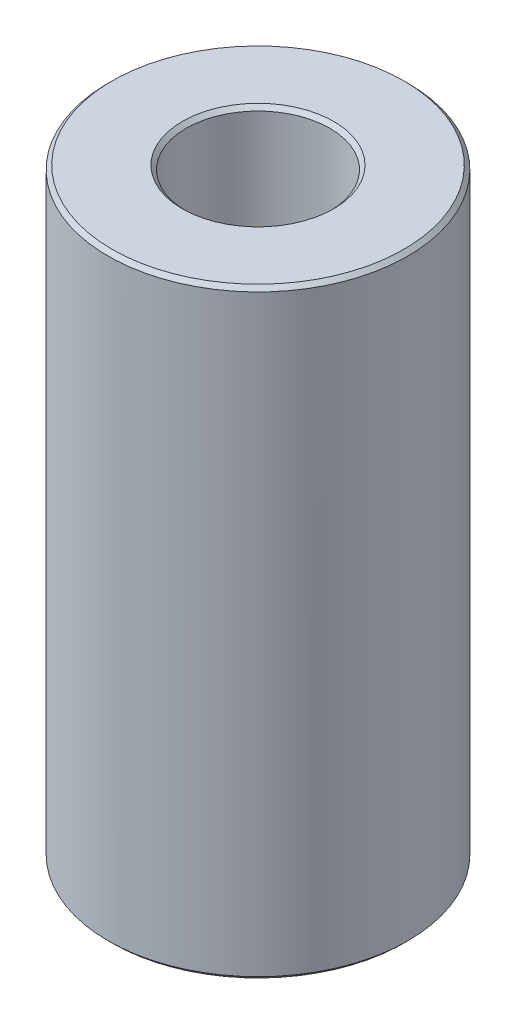
ISO-10303-21;
HEADER;
FILE_DESCRIPTION(('STEP AP214'),'2;1');
FILE_NAME('part.step','',(''),(''),'','','');
FILE_SCHEMA(('AUTOMOTIVE_DESIGN { 1 0 10303 214 1 1 1 1 }'));
ENDSEC;
DATA;
#1=APPLICATION_CONTEXT('core data for automotive mechanical design processes');
#2=APPLICATION_PROTOCOL_DEFINITION('international standard','automotive_design',2000,#1);
#3=PRODUCT_CONTEXT('',#1,'mechanical');
#4=PRODUCT('Part','Part','',(#3));
#5=PRODUCT_RELATED_PRODUCT_CATEGORY('part','',(#4));
#6=PRODUCT_DEFINITION_FORMATION('','',#4);
#7=PRODUCT_DEFINITION_CONTEXT('part definition',#1,'design');
#8=PRODUCT_DEFINITION('design','',#6,#7);
#9=PRODUCT_DEFINITION_SHAPE('','',#8);
#10=(LENGTH_UNIT() NAMED_UNIT(*) SI_UNIT(.MILLI.,.METRE.));
#11=(NAMED_UNIT(*) PLANE_ANGLE_UNIT() SI_UNIT($,.RADIAN.));
#12=(NAMED_UNIT(*) SI_UNIT($,.STERADIAN.) SOLID_ANGLE_UNIT());
#13=UNCERTAINTY_MEASURE_WITH_UNIT(LENGTH_MEASURE(1.E-05),#10,'distance_accuracy_value','');
#14=(GEOMETRIC_REPRESENTATION_CONTEXT(3) GLOBAL_UNCERTAINTY_ASSIGNED_CONTEXT((#13)) GLOBAL_UNIT_ASSIGNED_CONTEXT((#10,
#11,#12)) REPRESENTATION_CONTEXT('',''));
#15=CARTESIAN_POINT('',(0.,0.,0.));
#16=DIRECTION('',(0.,0.,1.));
#17=DIRECTION('',(1.,0.,0.));
#18=AXIS2_PLACEMENT_3D('',#15,#16,#17);
#19=CARTESIAN_POINT('',(0.,220.569360550062,0.));
#20=DIRECTION('',(0.,-1.,0.));
#21=DIRECTION('',(0.,0.,-1.));
#22=AXIS2_PLACEMENT_3D('',#19,#20,#21);
#23=CYLINDRICAL_SURFACE('',#22,55.);
#24=CARTESIAN_POINT('',(0.,1.44398311611005,0.));
#25=DIRECTION('',(0.,1.,0.));
#26=DIRECTION('',(0.,0.,1.));
#27=AXIS2_PLACEMENT_3D('',#24,#25,#26);
#28=CIRCLE('',#27,55.);
#29=CARTESIAN_POINT('',(0.,1.44398311611002,-55.));
#30=VERTEX_POINT('',#29);
#31=EDGE_CURVE('E10',#30,#30,#28,.T.);
#32=CARTESIAN_POINT('',(0.,219.125377433953,0.));
#33=DIRECTION('',(0.,1.,0.));
#34=DIRECTION('',(0.,0.,1.));
#35=AXIS2_PLACEMENT_3D('',#32,#33,#34);
#36=CIRCLE('',#35,55.);
#37=CARTESIAN_POINT('',(0.,219.125377433953,-55.));
#38=VERTEX_POINT('',#37);
#39=EDGE_CURVE('E50',#38,#38,#36,.F.);
#40=CARTESIAN_POINT('',(0.,1.44398311611002,-55.));
#41=CARTESIAN_POINT('',(0.,3.71149764025421,-55.));
#42=CARTESIAN_POINT('',(0.,5.9790121643984,-55.));
#43=CARTESIAN_POINT('',(0.,10.5140412126868,-55.));
#44=CARTESIAN_POINT('',(0.,12.781555736831,-55.));
#45=CARTESIAN_POINT('',(0.,17.3165847851194,-55.));
#46=CARTESIAN_POINT('',(0.,19.5840993092636,-55.));
#47=CARTESIAN_POINT('',(0.,24.119128357552,-55.));
#48=CARTESIAN_POINT('',(0.,26.3866428816961,-55.));
#49=CARTESIAN_POINT('',(0.,30.9216719299845,-55.));
#50=CARTESIAN_POINT('',(0.,33.1891864541287,-55.));
#51=CARTESIAN_POINT('',(0.,37.7242155024171,-55.));
#52=CARTESIAN_POINT('',(0.,39.9917300265613,-55.));
#53=CARTESIAN_POINT('',(0.,44.5267590748497,-55.));
#54=CARTESIAN_POINT('',(0.,46.7942735989939,-55.));
#55=CARTESIAN_POINT('',(0.,51.3293026472823,-55.));
#56=CARTESIAN_POINT('',(0.,53.5968171714265,-55.));
#57=CARTESIAN_POINT('',(0.,58.1318462197148,-55.));
#58=CARTESIAN_POINT('',(0.,60.399360743859,-55.));
#59=CARTESIAN_POINT('',(0.,64.9343897921474,-55.));
#60=CARTESIAN_POINT('',(0.,67.2019043162916,-55.));
#61=CARTESIAN_POINT('',(0.,71.73693336458,-55.));
#62=CARTESIAN_POINT('',(0.,74.0044478887242,-55.));
#63=CARTESIAN_POINT('',(0.,78.5394769370126,-55.));
#64=CARTESIAN_POINT('',(0.,80.8069914611568,-55.));
#65=CARTESIAN_POINT('',(0.,85.3420205094452,-55.));
#66=CARTESIAN_POINT('',(0.,87.6095350335894,-55.));
#67=CARTESIAN_POINT('',(0.,92.1445640818777,-55.));
#68=CARTESIAN_POINT('',(0.,94.4120786060219,-55.));
#69=CARTESIAN_POINT('',(0.,98.9471076543103,-55.));
#70=CARTESIAN_POINT('',(0.,101.214622178454,-55.));
#71=CARTESIAN_POINT('',(0.,105.749651226743,-55.));
#72=CARTESIAN_POINT('',(0.,108.017165750887,-55.));
#73=CARTESIAN_POINT('',(0.,112.552194799175,-55.));
#74=CARTESIAN_POINT('',(0.,114.81970932332,-55.));
#75=CARTESIAN_POINT('',(0.,119.354738371608,-55.));
#76=CARTESIAN_POINT('',(0.,121.622252895752,-55.));
#77=CARTESIAN_POINT('',(0.,126.157281944041,-55.));
#78=CARTESIAN_POINT('',(0.,128.424796468185,-55.));
#79=CARTESIAN_POINT('',(0.,132.959825516473,-55.));
#80=CARTESIAN_POINT('',(0.,135.227340040617,-55.));
#81=CARTESIAN_POINT('',(0.,139.762369088906,-55.));
#82=CARTESIAN_POINT('',(0.,142.02988361305,-55.));
#83=CARTESIAN_POINT('',(0.,146.564912661338,-55.));
#84=CARTESIAN_POINT('',(0.,148.832427185483,-55.));
#85=CARTESIAN_POINT('',(0.,153.367456233771,-55.));
#86=CARTESIAN_POINT('',(0.,155.634970757915,-55.));
#87=CARTESIAN_POINT('',(0.,160.169999806203,-55.));
#88=CARTESIAN_POINT('',(0.,162.437514330348,-55.));
#89=CARTESIAN_POINT('',(0.,166.972543378636,-55.));
#90=CARTESIAN_POINT('',(0.,169.24005790278,-55.));
#91=CARTESIAN_POINT('',(0.,173.775086951069,-55.));
#92=CARTESIAN_POINT('',(0.,176.042601475213,-55.));
#93=CARTESIAN_POINT('',(0.,180.577630523501,-55.));
#94=CARTESIAN_POINT('',(0.,182.845145047645,-55.));
#95=CARTESIAN_POINT('',(0.,187.380174095934,-55.));
#96=CARTESIAN_POINT('',(0.,189.647688620078,-55.));
#97=CARTESIAN_POINT('',(0.,194.182717668366,-55.));
#98=CARTESIAN_POINT('',(0.,196.450232192511,-55.));
#99=CARTESIAN_POINT('',(0.,200.985261240799,-55.));
#100=CARTESIAN_POINT('',(0.,203.252775764943,-55.));
#101=CARTESIAN_POINT('',(0.,207.787804813232,-55.));
#102=CARTESIAN_POINT('',(0.,210.055319337376,-55.));
#103=CARTESIAN_POINT('',(0.,214.590348385664,-55.));
#104=CARTESIAN_POINT('',(0.,216.857862909808,-55.));
#105=CARTESIAN_POINT('',(0.,219.125377433953,-55.));
#106=B_SPLINE_CURVE_WITH_KNOTS('',3,(#40,#41,#42,#43,#44,#45,#46,#47,#48,#49,#50,#51,#52,#53,
#54,#55,#56,#57,#58,#59,#60,#61,#62,#63,#64,#65,#66,#67,#68,#69,#70,#71,#72,#73,#74,#75,#76,#77,
#78,#79,#80,#81,#82,#83,#84,#85,#86,#87,#88,#89,#90,#91,#92,#93,#94,#95,#96,#97,#98,#99,#100,
#101,#102,#103,#104,#105),.UNSPECIFIED.,.F.,.F.,(4,2,2,2,2,2,2,2,2,2,2,2,2,2,2,2,2,2,2,2,2,2,2,
2,2,2,2,2,2,2,2,2,4),(0.,6.80254357243257,13.6050871448652,20.4076307172977,27.2101742897303,
34.0127178621629,40.8152614345955,47.6178050070281,54.4203485794606,61.2228921518932,
68.0254357243258,74.8279792967584,81.630522869191,88.4330664416235,95.2356100140561,
102.038153586489,108.840697158921,115.643240731354,122.445784303786,129.248327876219,
136.050871448652,142.853415021084,149.655958593517,156.458502165949,163.261045738382,
170.063589310814,176.866132883247,183.66867645568,190.471220028112,197.273763600545,
204.076307172977,210.87885074541,217.681394317842),.UNSPECIFIED.);
#107=EDGE_CURVE('BSEAM39',#30,#38,#106,.T.);
#108=ORIENTED_EDGE('',*,*,#31,.T.);
#109=ORIENTED_EDGE('',*,*,#39,.T.);
#110=ORIENTED_EDGE('',*,*,#107,.T.);
#111=ORIENTED_EDGE('',*,*,#107,.F.);
#112=EDGE_LOOP('',(#108,#110,#109,#111));
#113=FACE_BOUND('',#112,.T.);
#114=ADVANCED_FACE('F39',(#113),#23,.T.);
#115=CARTESIAN_POINT('',(0.,220.569360550062,0.));
#116=DIRECTION('',(0.,1.,0.));
#117=DIRECTION('',(0.,0.,1.));
#118=AXIS2_PLACEMENT_3D('',#115,#116,#117);
#119=PLANE('',#118);
#120=CARTESIAN_POINT('',(0.,220.569360550062,0.));
#121=DIRECTION('',(0.,1.,0.));
#122=DIRECTION('',(0.,0.,1.));
#123=AXIS2_PLACEMENT_3D('',#120,#121,#122);
#124=CIRCLE('',#123,27.7944788995037);
#125=CARTESIAN_POINT('',(0.,220.569360550062,27.7944788995037));
#126=VERTEX_POINT('',#125);
#127=EDGE_CURVE('E58',#126,#126,#124,.F.);
#128=ORIENTED_EDGE('',*,*,#127,.T.);
#129=EDGE_LOOP('',(#128));
#130=FACE_BOUND('',#129,.T.);
#131=CARTESIAN_POINT('',(0.,220.569360550062,0.));
#132=DIRECTION('',(0.,1.,0.));
#133=DIRECTION('',(0.,0.,1.));
#134=AXIS2_PLACEMENT_3D('',#131,#132,#133);
#135=CIRCLE('',#134,53.5560168838903);
#136=CARTESIAN_POINT('',(0.,220.569360550062,53.5560168838903));
#137=VERTEX_POINT('',#136);
#138=EDGE_CURVE('E61',#137,#137,#135,.T.);
#139=ORIENTED_EDGE('',*,*,#138,.T.);
#140=EDGE_LOOP('',(#139));
#141=FACE_BOUND('',#140,.T.);
#142=ADVANCED_FACE('F88',(#130,#141),#119,.T.);
#143=CARTESIAN_POINT('',(0.,0.,0.));
#144=DIRECTION('',(0.,1.,0.));
#145=DIRECTION('',(0.,0.,1.));
#146=AXIS2_PLACEMENT_3D('',#143,#144,#145);
#147=PLANE('',#146);
#148=CARTESIAN_POINT('',(0.,0.,0.));
#149=DIRECTION('',(0.,1.,0.));
#150=DIRECTION('',(0.,0.,1.));
#151=AXIS2_PLACEMENT_3D('',#148,#149,#150);
#152=CIRCLE('',#151,27.7944788995036);
#153=CARTESIAN_POINT('',(0.,0.,-27.7944788995036));
#154=VERTEX_POINT('',#153);
#155=EDGE_CURVE('E51',#154,#154,#152,.T.);
#156=ORIENTED_EDGE('',*,*,#155,.T.);
#157=EDGE_LOOP('',(#156));
#158=FACE_BOUND('',#157,.T.);
#159=CARTESIAN_POINT('',(0.,0.,0.));
#160=DIRECTION('',(0.,1.,0.));
#161=DIRECTION('',(0.,0.,1.));
#162=AXIS2_PLACEMENT_3D('',#159,#160,#161);
#163=CIRCLE('',#162,53.55601688389);
#164=CARTESIAN_POINT('',(0.,0.,53.55601688389));
#165=VERTEX_POINT('',#164);
#166=EDGE_CURVE('E54',#165,#165,#163,.F.);
#167=ORIENTED_EDGE('',*,*,#166,.T.);
#168=EDGE_LOOP('',(#167));
#169=FACE_BOUND('',#168,.T.);
#170=ADVANCED_FACE('F83',(#158,#169),#147,.F.);
#171=CARTESIAN_POINT('',(0.,220.569360550062,0.));
#172=DIRECTION('',(0.,-1.,0.));
#173=DIRECTION('',(0.,0.,-1.));
#174=AXIS2_PLACEMENT_3D('',#171,#172,#173);
#175=CYLINDRICAL_SURFACE('',#174,26.3504957833938);
#176=CARTESIAN_POINT('',(0.,219.125377433952,0.));
#177=DIRECTION('',(0.,1.,0.));
#178=DIRECTION('',(0.,0.,1.));
#179=AXIS2_PLACEMENT_3D('',#176,#177,#178);
#180=CIRCLE('',#179,26.3504957833938);
#181=CARTESIAN_POINT('',(0.,219.125377433952,-26.3504957833938));
#182=VERTEX_POINT('',#181);
#183=EDGE_CURVE('E67',#182,#182,#180,.T.);
#184=CARTESIAN_POINT('',(0.,1.44398311610977,0.));
#185=DIRECTION('',(0.,1.,0.));
#186=DIRECTION('',(0.,0.,1.));
#187=AXIS2_PLACEMENT_3D('',#184,#185,#186);
#188=CIRCLE('',#187,26.3504957833938);
#189=CARTESIAN_POINT('',(0.,1.44398311610974,-26.3504957833938));
#190=VERTEX_POINT('',#189);
#191=EDGE_CURVE('E69',#190,#190,#188,.F.);
#192=CARTESIAN_POINT('',(0.,219.125377433952,-26.3504957833938));
#193=CARTESIAN_POINT('',(0.,216.857862909808,-26.3504957833938));
#194=CARTESIAN_POINT('',(0.,214.590348385664,-26.3504957833938));
#195=CARTESIAN_POINT('',(0.,210.055319337376,-26.3504957833938));
#196=CARTESIAN_POINT('',(0.,207.787804813231,-26.3504957833938));
#197=CARTESIAN_POINT('',(0.,203.252775764943,-26.3504957833938));
#198=CARTESIAN_POINT('',(0.,200.985261240799,-26.3504957833938));
#199=CARTESIAN_POINT('',(0.,196.45023219251,-26.3504957833938));
#200=CARTESIAN_POINT('',(0.,194.182717668366,-26.3504957833938));
#201=CARTESIAN_POINT('',(0.,189.647688620078,-26.3504957833938));
#202=CARTESIAN_POINT('',(0.,187.380174095934,-26.3504957833938));
#203=CARTESIAN_POINT('',(0.,182.845145047645,-26.3504957833938));
#204=CARTESIAN_POINT('',(0.,180.577630523501,-26.3504957833938));
#205=CARTESIAN_POINT('',(0.,176.042601475213,-26.3504957833938));
#206=CARTESIAN_POINT('',(0.,173.775086951068,-26.3504957833938));
#207=CARTESIAN_POINT('',(0.,169.24005790278,-26.3504957833938));
#208=CARTESIAN_POINT('',(0.,166.972543378636,-26.3504957833938));
#209=CARTESIAN_POINT('',(0.,162.437514330348,-26.3504957833938));
#210=CARTESIAN_POINT('',(0.,160.169999806203,-26.3504957833938));
#211=CARTESIAN_POINT('',(0.,155.634970757915,-26.3504957833938));
#212=CARTESIAN_POINT('',(0.,153.367456233771,-26.3504957833938));
#213=CARTESIAN_POINT('',(0.,148.832427185482,-26.3504957833938));
#214=CARTESIAN_POINT('',(0.,146.564912661338,-26.3504957833938));
#215=CARTESIAN_POINT('',(0.,142.02988361305,-26.3504957833938));
#216=CARTESIAN_POINT('',(0.,139.762369088906,-26.3504957833938));
#217=CARTESIAN_POINT('',(0.,135.227340040617,-26.3504957833938));
#218=CARTESIAN_POINT('',(0.,132.959825516473,-26.3504957833938));
#219=CARTESIAN_POINT('',(0.,128.424796468185,-26.3504957833938));
#220=CARTESIAN_POINT('',(0.,126.15728194404,-26.3504957833938));
#221=CARTESIAN_POINT('',(0.,121.622252895752,-26.3504957833938));
#222=CARTESIAN_POINT('',(0.,119.354738371608,-26.3504957833938));
#223=CARTESIAN_POINT('',(0.,114.819709323319,-26.3504957833938));
#224=CARTESIAN_POINT('',(0.,112.552194799175,-26.3504957833938));
#225=CARTESIAN_POINT('',(0.,108.017165750887,-26.3504957833938));
#226=CARTESIAN_POINT('',(0.,105.749651226743,-26.3504957833938));
#227=CARTESIAN_POINT('',(0.,101.214622178454,-26.3504957833938));
#228=CARTESIAN_POINT('',(0.,98.9471076543101,-26.3504957833938));
#229=CARTESIAN_POINT('',(0.,94.4120786060217,-26.3504957833938));
#230=CARTESIAN_POINT('',(0.,92.1445640818775,-26.3504957833938));
#231=CARTESIAN_POINT('',(0.,87.6095350335891,-26.3504957833938));
#232=CARTESIAN_POINT('',(0.,85.3420205094449,-26.3504957833938));
#233=CARTESIAN_POINT('',(0.,80.8069914611565,-26.3504957833938));
#234=CARTESIAN_POINT('',(0.,78.5394769370123,-26.3504957833938));
#235=CARTESIAN_POINT('',(0.,74.0044478887239,-26.3504957833938));
#236=CARTESIAN_POINT('',(0.,71.7369333645798,-26.3504957833938));
#237=CARTESIAN_POINT('',(0.,67.2019043162914,-26.3504957833938));
#238=CARTESIAN_POINT('',(0.,64.9343897921472,-26.3504957833938));
#239=CARTESIAN_POINT('',(0.,60.3993607438588,-26.3504957833938));
#240=CARTESIAN_POINT('',(0.,58.1318462197146,-26.3504957833938));
#241=CARTESIAN_POINT('',(0.,53.5968171714262,-26.3504957833938));
#242=CARTESIAN_POINT('',(0.,51.329302647282,-26.3504957833938));
#243=CARTESIAN_POINT('',(0.,46.7942735989936,-26.3504957833938));
#244=CARTESIAN_POINT('',(0.,44.5267590748494,-26.3504957833938));
#245=CARTESIAN_POINT('',(0.,39.9917300265611,-26.3504957833938));
#246=CARTESIAN_POINT('',(0.,37.7242155024169,-26.3504957833938));
#247=CARTESIAN_POINT('',(0.,33.1891864541285,-26.3504957833938));
#248=CARTESIAN_POINT('',(0.,30.9216719299843,-26.3504957833938));
#249=CARTESIAN_POINT('',(0.,26.3866428816959,-26.3504957833938));
#250=CARTESIAN_POINT('',(0.,24.1191283575517,-26.3504957833938));
#251=CARTESIAN_POINT('',(0.,19.5840993092633,-26.3504957833938));
#252=CARTESIAN_POINT('',(0.,17.3165847851191,-26.3504957833938));
#253=CARTESIAN_POINT('',(0.,12.7815557368307,-26.3504957833938));
#254=CARTESIAN_POINT('',(0.,10.5140412126865,-26.3504957833938));
#255=CARTESIAN_POINT('',(0.,5.97901216439814,-26.3504957833938));
#256=CARTESIAN_POINT('',(0.,3.71149764025394,-26.3504957833938));
#257=CARTESIAN_POINT('',(0.,1.44398311610974,-26.3504957833938));
#258=B_SPLINE_CURVE_WITH_KNOTS('',3,(#192,#193,#194,#195,#196,#197,#198,#199,#200,#201,#202,
#203,#204,#205,#206,#207,#208,#209,#210,#211,#212,#213,#214,#215,#216,#217,#218,#219,#220,#221,
#222,#223,#224,#225,#226,#227,#228,#229,#230,#231,#232,#233,#234,#235,#236,#237,#238,#239,#240,
#241,#242,#243,#244,#245,#246,#247,#248,#249,#250,#251,#252,#253,#254,#255,#256,#257),
.UNSPECIFIED.,.F.,.F.,(4,2,2,2,2,2,2,2,2,2,2,2,2,2,2,2,2,2,2,2,2,2,2,2,2,2,2,2,2,2,2,2,4),(0.,
6.8025435724326,13.6050871448652,20.4076307172978,27.2101742897303,34.0127178621629,
40.8152614345955,47.6178050070281,54.4203485794607,61.2228921518932,68.0254357243258,
74.8279792967584,81.630522869191,88.4330664416236,95.2356100140561,102.038153586489,
108.840697158921,115.643240731354,122.445784303786,129.248327876219,136.050871448652,
142.853415021084,149.655958593517,156.458502165949,163.261045738382,170.063589310815,
176.866132883247,183.66867645568,190.471220028112,197.273763600545,204.076307172977,
210.87885074541,217.681394317843),.UNSPECIFIED.);
#259=EDGE_CURVE('BSEAM71',#182,#190,#258,.T.);
#260=ORIENTED_EDGE('',*,*,#183,.T.);
#261=ORIENTED_EDGE('',*,*,#191,.T.);
#262=ORIENTED_EDGE('',*,*,#259,.T.);
#263=ORIENTED_EDGE('',*,*,#259,.F.);
#264=EDGE_LOOP('',(#260,#262,#261,#263));
#265=FACE_BOUND('',#264,.T.);
#266=ADVANCED_FACE('F71',(#265),#175,.F.);
#267=CARTESIAN_POINT('',(0.,219.125377433952,0.));
#268=DIRECTION('',(0.,1.,0.));
#269=DIRECTION('',(0.,0.,1.));
#270=AXIS2_PLACEMENT_3D('',#267,#268,#269);
#271=CONICAL_SURFACE('',#270,26.3504957833938,0.785398163397444);
#272=ORIENTED_EDGE('',*,*,#127,.F.);
#273=EDGE_LOOP('',(#272));
#274=FACE_BOUND('',#273,.T.);
#275=ORIENTED_EDGE('',*,*,#183,.F.);
#276=EDGE_LOOP('',(#275));
#277=FACE_BOUND('',#276,.T.);
#278=ADVANCED_FACE('F77',(#274,#277),#271,.F.);
#279=CARTESIAN_POINT('',(0.,0.,0.));
#280=DIRECTION('',(0.,-1.,0.));
#281=DIRECTION('',(0.,0.,-1.));
#282=AXIS2_PLACEMENT_3D('',#279,#280,#281);
#283=CONICAL_SURFACE('',#282,27.7944788995036,0.785398163397453);
#284=CARTESIAN_POINT('',(0.,1.44398311610977,-26.3504957833938));
#285=CARTESIAN_POINT('',(0.,1.42894162531696,-26.3655372741866));
#286=CARTESIAN_POINT('',(0.,1.41390013452415,-26.3805787649794));
#287=CARTESIAN_POINT('',(0.,1.38381715293853,-26.410661746565));
#288=CARTESIAN_POINT('',(0.,1.36877566214572,-26.4257032373579));
#289=CARTESIAN_POINT('',(0.,1.3386926805601,-26.4557862189435));
#290=CARTESIAN_POINT('',(0.,1.32365118976729,-26.4708277097363));
#291=CARTESIAN_POINT('',(0.,1.29356820818167,-26.5009106913219));
#292=CARTESIAN_POINT('',(0.,1.27852671738886,-26.5159521821147));
#293=CARTESIAN_POINT('',(0.,1.24844373580324,-26.5460351637003));
#294=CARTESIAN_POINT('',(0.,1.23340224501043,-26.5610766544931));
#295=CARTESIAN_POINT('',(0.,1.20331926342481,-26.5911596360788));
#296=CARTESIAN_POINT('',(0.,1.188277772632,-26.6062011268716));
#297=CARTESIAN_POINT('',(0.,1.15819479104638,-26.6362841084572));
#298=CARTESIAN_POINT('',(0.,1.14315330025357,-26.65132559925));
#299=CARTESIAN_POINT('',(0.,1.11307031866795,-26.6814085808356));
#300=CARTESIAN_POINT('',(0.,1.09802882787514,-26.6964500716284));
#301=CARTESIAN_POINT('',(0.,1.06794584628952,-26.7265330532141));
#302=CARTESIAN_POINT('',(0.,1.05290435549671,-26.7415745440069));
#303=CARTESIAN_POINT('',(0.,1.02282137391109,-26.7716575255925));
#304=CARTESIAN_POINT('',(0.,1.00777988311828,-26.7866990163853));
#305=CARTESIAN_POINT('',(0.,0.977696901532657,-26.8167819979709));
#306=CARTESIAN_POINT('',(0.,0.962655410739847,-26.8318234887637));
#307=CARTESIAN_POINT('',(0.,0.932572429154227,-26.8619064703494));
#308=CARTESIAN_POINT('',(0.,0.917530938361417,-26.8769479611422));
#309=CARTESIAN_POINT('',(0.,0.887447956775796,-26.9070309427278));
#310=CARTESIAN_POINT('',(0.,0.872406465982986,-26.9220724335206));
#311=CARTESIAN_POINT('',(0.,0.842323484397366,-26.9521554151062));
#312=CARTESIAN_POINT('',(0.,0.827281993604556,-26.967196905899));
#313=CARTESIAN_POINT('',(0.,0.797199012018936,-26.9972798874846));
#314=CARTESIAN_POINT('',(0.,0.782157521226125,-27.0123213782775));
#315=CARTESIAN_POINT('',(0.,0.752074539640505,-27.0424043598631));
#316=CARTESIAN_POINT('',(0.,0.737033048847695,-27.0574458506559));
#317=CARTESIAN_POINT('',(0.,0.706950067262075,-27.0875288322415));
#318=CARTESIAN_POINT('',(0.,0.691908576469265,-27.1025703230343));
#319=CARTESIAN_POINT('',(0.,0.661825594883645,-27.1326533046199));
#320=CARTESIAN_POINT('',(0.,0.646784104090834,-27.1476947954128));
#321=CARTESIAN_POINT('',(0.,0.616701122505214,-27.1777777769984));
#322=CARTESIAN_POINT('',(0.,0.601659631712404,-27.1928192677912));
#323=CARTESIAN_POINT('',(0.,0.571576650126784,-27.2229022493768));
#324=CARTESIAN_POINT('',(0.,0.556535159333974,-27.2379437401696));
#325=CARTESIAN_POINT('',(0.,0.526452177748354,-27.2680267217552));
#326=CARTESIAN_POINT('',(0.,0.511410686955543,-27.283068212548));
#327=CARTESIAN_POINT('',(0.,0.481327705369923,-27.3131511941337));
#328=CARTESIAN_POINT('',(0.,0.466286214577114,-27.3281926849265));
#329=CARTESIAN_POINT('',(0.,0.436203232991493,-27.3582756665121));
#330=CARTESIAN_POINT('',(0.,0.421161742198683,-27.3733171573049));
#331=CARTESIAN_POINT('',(0.,0.391078760613062,-27.4034001388905));
#332=CARTESIAN_POINT('',(0.,0.376037269820252,-27.4184416296833));
#333=CARTESIAN_POINT('',(0.,0.345954288234633,-27.448524611269));
#334=CARTESIAN_POINT('',(0.,0.330912797441823,-27.4635661020618));
#335=CARTESIAN_POINT('',(0.,0.300829815856202,-27.4936490836474));
#336=CARTESIAN_POINT('',(0.,0.285788325063392,-27.5086905744402));
#337=CARTESIAN_POINT('',(0.,0.255705343477772,-27.5387735560258));
#338=CARTESIAN_POINT('',(0.,0.240663852684962,-27.5538150468186));
#339=CARTESIAN_POINT('',(0.,0.210580871099342,-27.5838980284042));
#340=CARTESIAN_POINT('',(0.,0.195539380306531,-27.5989395191971));
#341=CARTESIAN_POINT('',(0.,0.165456398720911,-27.6290225007827));
#342=CARTESIAN_POINT('',(0.,0.150414907928101,-27.6440639915755));
#343=CARTESIAN_POINT('',(0.,0.120331926342481,-27.6741469731611));
#344=CARTESIAN_POINT('',(0.,0.105290435549671,-27.6891884639539));
#345=CARTESIAN_POINT('',(0.,0.0752074539640508,-27.7192714455395));
#346=CARTESIAN_POINT('',(0.,0.0601659631712404,-27.7343129363323));
#347=CARTESIAN_POINT('',(0.,0.0300829815856197,-27.764395917918));
#348=CARTESIAN_POINT('',(0.,0.0150414907928093,-27.7794374087108));
#349=CARTESIAN_POINT('',(0.,0.,-27.7944788995036));
#350=B_SPLINE_CURVE_WITH_KNOTS('',3,(#284,#285,#286,#287,#288,#289,#290,#291,#292,#293,#294,
#295,#296,#297,#298,#299,#300,#301,#302,#303,#304,#305,#306,#307,#308,#309,#310,#311,#312,#313,
#314,#315,#316,#317,#318,#319,#320,#321,#322,#323,#324,#325,#326,#327,#328,#329,#330,#331,#332,
#333,#334,#335,#336,#337,#338,#339,#340,#341,#342,#343,#344,#345,#346,#347,#348,#349),
.UNSPECIFIED.,.F.,.F.,(4,2,2,2,2,2,2,2,2,2,2,2,2,2,2,2,2,2,2,2,2,2,2,2,2,2,2,2,2,2,2,2,4),(0.,
0.0638156408325075,0.127631281665013,0.19144692249752,0.255262563330028,0.319078204162533,
0.38289384499504,0.446709485827545,0.510525126660053,0.57434076749256,0.638156408325065,
0.701972049157573,0.76578768999008,0.829603330822585,0.893418971655093,0.957234612487598,
1.02105025332011,1.08486589415261,1.14868153498512,1.21249717581763,1.27631281665013,
1.34012845748264,1.40394409831515,1.46775973914765,1.53157537998016,1.59539102081267,
1.65920666164517,1.72302230247768,1.78683794331018,1.85065358414269,1.9144692249752,
1.9782848658077,2.04210050664021),.UNSPECIFIED.);
#351=EDGE_CURVE('BSEAM73',#190,#154,#350,.T.);
#352=ORIENTED_EDGE('',*,*,#191,.F.);
#353=ORIENTED_EDGE('',*,*,#155,.F.);
#354=ORIENTED_EDGE('',*,*,#351,.T.);
#355=ORIENTED_EDGE('',*,*,#351,.F.);
#356=EDGE_LOOP('',(#352,#354,#353,#355));
#357=FACE_BOUND('',#356,.T.);
#358=ADVANCED_FACE('F73',(#357),#283,.F.);
#359=CARTESIAN_POINT('',(0.,1.44398311611005,0.));
#360=DIRECTION('',(0.,1.,0.));
#361=DIRECTION('',(0.,0.,1.));
#362=AXIS2_PLACEMENT_3D('',#359,#360,#361);
#363=CONICAL_SURFACE('',#362,55.,0.785398163397443);
#364=ORIENTED_EDGE('',*,*,#166,.F.);
#365=EDGE_LOOP('',(#364));
#366=FACE_BOUND('',#365,.T.);
#367=ORIENTED_EDGE('',*,*,#31,.F.);
#368=EDGE_LOOP('',(#367));
#369=FACE_BOUND('',#368,.T.);
#370=ADVANCED_FACE('F76',(#366,#369),#363,.T.);
#371=CARTESIAN_POINT('',(0.,220.569360550062,0.));
#372=DIRECTION('',(0.,-1.,0.));
#373=DIRECTION('',(0.,0.,-1.));
#374=AXIS2_PLACEMENT_3D('',#371,#372,#373);
#375=CONICAL_SURFACE('',#374,53.5560168838903,0.785398163397446);
#376=ORIENTED_EDGE('',*,*,#39,.F.);
#377=EDGE_LOOP('',(#376));
#378=FACE_BOUND('',#377,.T.);
#379=ORIENTED_EDGE('',*,*,#138,.F.);
#380=EDGE_LOOP('',(#379));
#381=FACE_BOUND('',#380,.T.);
#382=ADVANCED_FACE('F45',(#378,#381),#375,.T.);
#383=CLOSED_SHELL('',(#114,#142,#170,#266,#278,#358,#370,#382));
#384=MANIFOLD_SOLID_BREP('B2',#383);
#385=ADVANCED_BREP_SHAPE_REPRESENTATION('',(#18,#384),#14);
#386=SHAPE_DEFINITION_REPRESENTATION(#9,#385);
ENDSEC;
END-ISO-10303-21;
